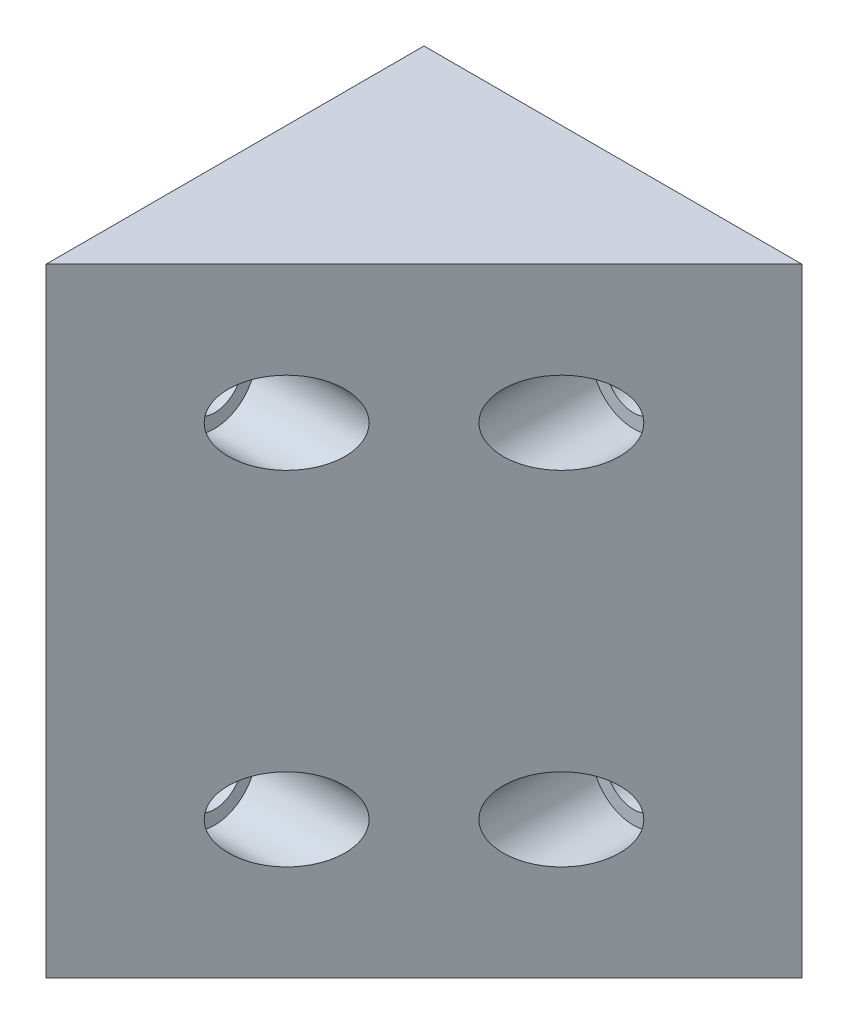
ISO-10303-21;
HEADER;
FILE_DESCRIPTION(('STEP AP214'),'2;1');
FILE_NAME('part.step','',(''),(''),'','','');
FILE_SCHEMA(('AUTOMOTIVE_DESIGN { 1 0 10303 214 1 1 1 1 }'));
ENDSEC;
DATA;
#1=APPLICATION_CONTEXT('core data for automotive mechanical design processes');
#2=APPLICATION_PROTOCOL_DEFINITION('international standard','automotive_design',2000,#1);
#3=PRODUCT_CONTEXT('',#1,'mechanical');
#4=PRODUCT('Part','Part','',(#3));
#5=PRODUCT_RELATED_PRODUCT_CATEGORY('part','',(#4));
#6=PRODUCT_DEFINITION_FORMATION('','',#4);
#7=PRODUCT_DEFINITION_CONTEXT('part definition',#1,'design');
#8=PRODUCT_DEFINITION('design','',#6,#7);
#9=PRODUCT_DEFINITION_SHAPE('','',#8);
#10=(LENGTH_UNIT() NAMED_UNIT(*) SI_UNIT(.MILLI.,.METRE.));
#11=(NAMED_UNIT(*) PLANE_ANGLE_UNIT() SI_UNIT($,.RADIAN.));
#12=(NAMED_UNIT(*) SI_UNIT($,.STERADIAN.) SOLID_ANGLE_UNIT());
#13=UNCERTAINTY_MEASURE_WITH_UNIT(LENGTH_MEASURE(1.E-05),#10,'distance_accuracy_value','');
#14=(GEOMETRIC_REPRESENTATION_CONTEXT(3) GLOBAL_UNCERTAINTY_ASSIGNED_CONTEXT((#13)) GLOBAL_UNIT_ASSIGNED_CONTEXT((#10,
#11,#12)) REPRESENTATION_CONTEXT('',''));
#15=CARTESIAN_POINT('',(0.,0.,0.));
#16=DIRECTION('',(0.,0.,1.));
#17=DIRECTION('',(1.,0.,0.));
#18=AXIS2_PLACEMENT_3D('',#15,#16,#17);
#19=CARTESIAN_POINT('',(0.,100.,0.));
#20=DIRECTION('',(1.,0.,0.));
#21=DIRECTION('',(0.,0.,-1.));
#22=AXIS2_PLACEMENT_3D('',#19,#20,#21);
#23=PLANE('',#22);
#24=CARTESIAN_POINT('',(0.,75.,-17.5));
#25=DIRECTION('',(1.,0.,0.));
#26=DIRECTION('',(0.,0.,-1.));
#27=AXIS2_PLACEMENT_3D('',#24,#25,#26);
#28=CIRCLE('',#27,4.);
#29=CARTESIAN_POINT('',(0.,75.,-21.5));
#30=VERTEX_POINT('',#29);
#31=EDGE_CURVE('E111',#30,#30,#28,.F.);
#32=ORIENTED_EDGE('',*,*,#31,.F.);
#33=EDGE_LOOP('',(#32));
#34=FACE_BOUND('',#33,.T.);
#35=CARTESIAN_POINT('',(0.,25.,-17.5));
#36=DIRECTION('',(1.,0.,0.));
#37=DIRECTION('',(0.,0.,-1.));
#38=AXIS2_PLACEMENT_3D('',#35,#36,#37);
#39=CIRCLE('',#38,4.);
#40=CARTESIAN_POINT('',(0.,25.,-21.5));
#41=VERTEX_POINT('',#40);
#42=EDGE_CURVE('E112',#41,#41,#39,.F.);
#43=ORIENTED_EDGE('',*,*,#42,.F.);
#44=EDGE_LOOP('',(#43));
#45=FACE_BOUND('',#44,.T.);
#46=DIRECTION('',(0.,-1.,0.));
#47=VECTOR('',#46,1.);
#48=CARTESIAN_POINT('',(0.,100.,0.));
#49=LINE('',#48,#47);
#50=CARTESIAN_POINT('',(0.,95.,0.));
#51=VERTEX_POINT('',#50);
#52=CARTESIAN_POINT('',(0.,5.,0.));
#53=VERTEX_POINT('',#52);
#54=EDGE_CURVE('E11',#51,#53,#49,.T.);
#55=ORIENTED_EDGE('',*,*,#54,.F.);
#56=DIRECTION('',(0.,0.,1.));
#57=VECTOR('',#56,1.);
#58=CARTESIAN_POINT('',(0.,95.,-110.226805085936));
#59=LINE('',#58,#57);
#60=CARTESIAN_POINT('',(0.,95.,-55.));
#61=VERTEX_POINT('',#60);
#62=EDGE_CURVE('E67',#61,#51,#59,.T.);
#63=ORIENTED_EDGE('',*,*,#62,.F.);
#64=DIRECTION('',(0.,-1.,0.));
#65=VECTOR('',#64,1.);
#66=CARTESIAN_POINT('',(0.,100.,-55.));
#67=LINE('',#66,#65);
#68=CARTESIAN_POINT('',(0.,5.,-55.));
#69=VERTEX_POINT('',#68);
#70=EDGE_CURVE('E84',#61,#69,#67,.T.);
#71=ORIENTED_EDGE('',*,*,#70,.T.);
#72=DIRECTION('',(0.,0.,1.));
#73=VECTOR('',#72,1.);
#74=CARTESIAN_POINT('',(0.,5.,-110.226805085936));
#75=LINE('',#74,#73);
#76=EDGE_CURVE('E57',#69,#53,#75,.T.);
#77=ORIENTED_EDGE('',*,*,#76,.T.);
#78=EDGE_LOOP('',(#55,#63,#71,#77));
#79=FACE_BOUND('',#78,.T.);
#80=ADVANCED_FACE('F33',(#34,#45,#79),#23,.F.);
#81=CARTESIAN_POINT('',(0.,100.,0.));
#82=DIRECTION('',(-0.707106781186548,0.,-0.707106781186548));
#83=DIRECTION('',(-0.707106781186548,0.,0.707106781186548));
#84=AXIS2_PLACEMENT_3D('',#81,#82,#83);
#85=PLANE('',#84);
#86=CARTESIAN_POINT('',(37.4999999999998,25.,-37.4999999999998));
#87=DIRECTION('',(-0.707106781186548,0.,-0.707106781186548));
#88=DIRECTION('',(-0.707106781186548,0.,0.707106781186548));
#89=AXIS2_PLACEMENT_3D('',#86,#87,#88);
#90=ELLIPSE('',#89,8.48528137423866,6.);
#91=CARTESIAN_POINT('',(31.4999999999998,25.,-31.4999999999998));
#92=VERTEX_POINT('',#91);
#93=EDGE_CURVE('E36',#92,#92,#90,.F.);
#94=ORIENTED_EDGE('',*,*,#93,.F.);
#95=EDGE_LOOP('',(#94));
#96=FACE_BOUND('',#95,.T.);
#97=CARTESIAN_POINT('',(37.4999999999998,75.,-37.4999999999998));
#98=DIRECTION('',(-0.707106781186548,0.,-0.707106781186548));
#99=DIRECTION('',(-0.707106781186548,0.,0.707106781186548));
#100=AXIS2_PLACEMENT_3D('',#97,#98,#99);
#101=ELLIPSE('',#100,8.48528137423866,6.);
#102=CARTESIAN_POINT('',(31.4999999999998,75.,-31.4999999999998));
#103=VERTEX_POINT('',#102);
#104=EDGE_CURVE('E105',#103,#103,#101,.F.);
#105=ORIENTED_EDGE('',*,*,#104,.F.);
#106=EDGE_LOOP('',(#105));
#107=FACE_BOUND('',#106,.T.);
#108=CARTESIAN_POINT('',(17.5,25.,-17.5));
#109=DIRECTION('',(-0.707106781186548,0.,-0.707106781186548));
#110=DIRECTION('',(0.707106781186548,0.,-0.707106781186548));
#111=AXIS2_PLACEMENT_3D('',#108,#109,#110);
#112=ELLIPSE('',#111,8.48528137423857,6.);
#113=CARTESIAN_POINT('',(23.5,25.,-23.5));
#114=VERTEX_POINT('',#113);
#115=EDGE_CURVE('E128',#114,#114,#112,.T.);
#116=ORIENTED_EDGE('',*,*,#115,.T.);
#117=EDGE_LOOP('',(#116));
#118=FACE_BOUND('',#117,.T.);
#119=CARTESIAN_POINT('',(17.5,75.,-17.5));
#120=DIRECTION('',(-0.707106781186548,0.,-0.707106781186548));
#121=DIRECTION('',(0.707106781186548,0.,-0.707106781186548));
#122=AXIS2_PLACEMENT_3D('',#119,#120,#121);
#123=ELLIPSE('',#122,8.48528137423857,6.);
#124=CARTESIAN_POINT('',(23.5,75.,-23.5));
#125=VERTEX_POINT('',#124);
#126=EDGE_CURVE('E124',#125,#125,#123,.T.);
#127=ORIENTED_EDGE('',*,*,#126,.T.);
#128=EDGE_LOOP('',(#127));
#129=FACE_BOUND('',#128,.T.);
#130=DIRECTION('',(0.,-1.,0.));
#131=VECTOR('',#130,1.);
#132=CARTESIAN_POINT('',(55.,100.,-55.));
#133=LINE('',#132,#131);
#134=CARTESIAN_POINT('',(55.,95.,-55.));
#135=VERTEX_POINT('',#134);
#136=CARTESIAN_POINT('',(55.,5.,-55.));
#137=VERTEX_POINT('',#136);
#138=EDGE_CURVE('E41',#135,#137,#133,.T.);
#139=ORIENTED_EDGE('',*,*,#138,.F.);
#140=DIRECTION('',(-0.707106781186548,0.,0.707106781186548));
#141=VECTOR('',#140,1.);
#142=CARTESIAN_POINT('',(0.,95.,0.));
#143=LINE('',#142,#141);
#144=EDGE_CURVE('E49',#135,#51,#143,.T.);
#145=ORIENTED_EDGE('',*,*,#144,.T.);
#146=ORIENTED_EDGE('',*,*,#54,.T.);
#147=DIRECTION('',(0.707106781186548,0.,-0.707106781186548));
#148=VECTOR('',#147,1.);
#149=CARTESIAN_POINT('',(0.,5.,0.));
#150=LINE('',#149,#148);
#151=EDGE_CURVE('E82',#53,#137,#150,.T.);
#152=ORIENTED_EDGE('',*,*,#151,.T.);
#153=EDGE_LOOP('',(#139,#145,#146,#152));
#154=FACE_BOUND('',#153,.T.);
#155=ADVANCED_FACE('F78',(#96,#107,#118,#129,#154),#85,.F.);
#156=CARTESIAN_POINT('',(0.,100.,-55.));
#157=DIRECTION('',(0.,0.,1.));
#158=DIRECTION('',(1.,0.,0.));
#159=AXIS2_PLACEMENT_3D('',#156,#157,#158);
#160=PLANE('',#159);
#161=CARTESIAN_POINT('',(37.4999999999999,75.,-55.));
#162=DIRECTION('',(0.,0.,1.));
#163=DIRECTION('',(1.,0.,0.));
#164=AXIS2_PLACEMENT_3D('',#161,#162,#163);
#165=CIRCLE('',#164,4.);
#166=CARTESIAN_POINT('',(41.4999999999999,75.,-55.));
#167=VERTEX_POINT('',#166);
#168=EDGE_CURVE('E93',#167,#167,#165,.F.);
#169=ORIENTED_EDGE('',*,*,#168,.F.);
#170=EDGE_LOOP('',(#169));
#171=FACE_BOUND('',#170,.T.);
#172=CARTESIAN_POINT('',(37.4999999999999,25.,-55.));
#173=DIRECTION('',(0.,0.,1.));
#174=DIRECTION('',(1.,0.,0.));
#175=AXIS2_PLACEMENT_3D('',#172,#173,#174);
#176=CIRCLE('',#175,4.);
#177=CARTESIAN_POINT('',(41.4999999999999,25.,-55.));
#178=VERTEX_POINT('',#177);
#179=EDGE_CURVE('E94',#178,#178,#176,.F.);
#180=ORIENTED_EDGE('',*,*,#179,.F.);
#181=EDGE_LOOP('',(#180));
#182=FACE_BOUND('',#181,.T.);
#183=ORIENTED_EDGE('',*,*,#70,.F.);
#184=DIRECTION('',(-1.,0.,0.));
#185=VECTOR('',#184,1.);
#186=CARTESIAN_POINT('',(0.,95.,-55.));
#187=LINE('',#186,#185);
#188=EDGE_CURVE('E69',#135,#61,#187,.T.);
#189=ORIENTED_EDGE('',*,*,#188,.F.);
#190=ORIENTED_EDGE('',*,*,#138,.T.);
#191=DIRECTION('',(1.,0.,0.));
#192=VECTOR('',#191,1.);
#193=CARTESIAN_POINT('',(0.,5.,-55.));
#194=LINE('',#193,#192);
#195=EDGE_CURVE('E74',#69,#137,#194,.T.);
#196=ORIENTED_EDGE('',*,*,#195,.F.);
#197=EDGE_LOOP('',(#183,#189,#190,#196));
#198=FACE_BOUND('',#197,.T.);
#199=ADVANCED_FACE('F143',(#171,#182,#198),#160,.F.);
#200=CARTESIAN_POINT('',(7.00000000000001,75.,-17.5));
#201=DIRECTION('',(1.,0.,0.));
#202=DIRECTION('',(0.,0.,-1.));
#203=AXIS2_PLACEMENT_3D('',#200,#201,#202);
#204=CYLINDRICAL_SURFACE('',#203,6.);
#205=CARTESIAN_POINT('',(7.00000000000001,75.,-17.5));
#206=DIRECTION('',(1.,0.,0.));
#207=DIRECTION('',(0.,0.,-1.));
#208=AXIS2_PLACEMENT_3D('',#205,#206,#207);
#209=CIRCLE('',#208,6.);
#210=CARTESIAN_POINT('',(7.00000000000001,75.,-23.5));
#211=VERTEX_POINT('',#210);
#212=EDGE_CURVE('E115',#211,#211,#209,.T.);
#213=ORIENTED_EDGE('',*,*,#212,.F.);
#214=EDGE_LOOP('',(#213));
#215=FACE_BOUND('',#214,.T.);
#216=ORIENTED_EDGE('',*,*,#126,.F.);
#217=EDGE_LOOP('',(#216));
#218=FACE_BOUND('',#217,.T.);
#219=ADVANCED_FACE('F149',(#215,#218),#204,.F.);
#220=CARTESIAN_POINT('',(7.00000000000001,75.,-17.5));
#221=DIRECTION('',(1.,0.,0.));
#222=DIRECTION('',(0.,0.,-1.));
#223=AXIS2_PLACEMENT_3D('',#220,#221,#222);
#224=PLANE('',#223);
#225=CARTESIAN_POINT('',(7.00000000000001,75.,-17.5));
#226=DIRECTION('',(1.,0.,0.));
#227=DIRECTION('',(0.,0.,-1.));
#228=AXIS2_PLACEMENT_3D('',#225,#226,#227);
#229=CIRCLE('',#228,4.);
#230=CARTESIAN_POINT('',(7.00000000000001,75.,-21.5));
#231=VERTEX_POINT('',#230);
#232=EDGE_CURVE('E108',#231,#231,#229,.T.);
#233=ORIENTED_EDGE('',*,*,#232,.F.);
#234=EDGE_LOOP('',(#233));
#235=FACE_BOUND('',#234,.T.);
#236=ORIENTED_EDGE('',*,*,#212,.T.);
#237=EDGE_LOOP('',(#236));
#238=FACE_BOUND('',#237,.T.);
#239=ADVANCED_FACE('F151',(#235,#238),#224,.T.);
#240=CARTESIAN_POINT('',(7.00000000000001,25.,-17.5));
#241=DIRECTION('',(1.,0.,0.));
#242=DIRECTION('',(0.,0.,-1.));
#243=AXIS2_PLACEMENT_3D('',#240,#241,#242);
#244=CYLINDRICAL_SURFACE('',#243,6.);
#245=CARTESIAN_POINT('',(7.00000000000001,25.,-17.5));
#246=DIRECTION('',(1.,0.,0.));
#247=DIRECTION('',(0.,0.,-1.));
#248=AXIS2_PLACEMENT_3D('',#245,#246,#247);
#249=CIRCLE('',#248,6.);
#250=CARTESIAN_POINT('',(7.00000000000001,25.,-23.5));
#251=VERTEX_POINT('',#250);
#252=EDGE_CURVE('E121',#251,#251,#249,.T.);
#253=ORIENTED_EDGE('',*,*,#252,.F.);
#254=EDGE_LOOP('',(#253));
#255=FACE_BOUND('',#254,.T.);
#256=ORIENTED_EDGE('',*,*,#115,.F.);
#257=EDGE_LOOP('',(#256));
#258=FACE_BOUND('',#257,.T.);
#259=ADVANCED_FACE('F158',(#255,#258),#244,.F.);
#260=CARTESIAN_POINT('',(7.00000000000001,25.,-17.5));
#261=DIRECTION('',(1.,0.,0.));
#262=DIRECTION('',(0.,0.,-1.));
#263=AXIS2_PLACEMENT_3D('',#260,#261,#262);
#264=PLANE('',#263);
#265=CARTESIAN_POINT('',(7.00000000000001,25.,-17.5));
#266=DIRECTION('',(1.,0.,0.));
#267=DIRECTION('',(0.,0.,-1.));
#268=AXIS2_PLACEMENT_3D('',#265,#266,#267);
#269=CIRCLE('',#268,4.);
#270=CARTESIAN_POINT('',(7.00000000000001,25.,-21.5));
#271=VERTEX_POINT('',#270);
#272=EDGE_CURVE('E116',#271,#271,#269,.T.);
#273=ORIENTED_EDGE('',*,*,#272,.F.);
#274=EDGE_LOOP('',(#273));
#275=FACE_BOUND('',#274,.T.);
#276=ORIENTED_EDGE('',*,*,#252,.T.);
#277=EDGE_LOOP('',(#276));
#278=FACE_BOUND('',#277,.T.);
#279=ADVANCED_FACE('F176',(#275,#278),#264,.T.);
#280=CARTESIAN_POINT('',(-11.3137084989848,25.,-17.5));
#281=DIRECTION('',(1.,0.,0.));
#282=DIRECTION('',(0.,0.,-1.));
#283=AXIS2_PLACEMENT_3D('',#280,#281,#282);
#284=CYLINDRICAL_SURFACE('',#283,4.);
#285=ORIENTED_EDGE('',*,*,#42,.T.);
#286=EDGE_LOOP('',(#285));
#287=FACE_BOUND('',#286,.T.);
#288=ORIENTED_EDGE('',*,*,#272,.T.);
#289=EDGE_LOOP('',(#288));
#290=FACE_BOUND('',#289,.T.);
#291=ADVANCED_FACE('F172',(#287,#290),#284,.F.);
#292=CARTESIAN_POINT('',(-11.3137084989848,75.,-17.5));
#293=DIRECTION('',(1.,0.,0.));
#294=DIRECTION('',(0.,0.,-1.));
#295=AXIS2_PLACEMENT_3D('',#292,#293,#294);
#296=CYLINDRICAL_SURFACE('',#295,4.);
#297=ORIENTED_EDGE('',*,*,#31,.T.);
#298=EDGE_LOOP('',(#297));
#299=FACE_BOUND('',#298,.T.);
#300=ORIENTED_EDGE('',*,*,#232,.T.);
#301=EDGE_LOOP('',(#300));
#302=FACE_BOUND('',#301,.T.);
#303=ADVANCED_FACE('F175',(#299,#302),#296,.F.);
#304=CARTESIAN_POINT('',(37.4999999999999,75.,-47.9999999999996));
#305=DIRECTION('',(0.,0.,1.));
#306=DIRECTION('',(1.,0.,0.));
#307=AXIS2_PLACEMENT_3D('',#304,#305,#306);
#308=CYLINDRICAL_SURFACE('',#307,6.);
#309=CARTESIAN_POINT('',(37.4999999999999,75.,-47.9999999999996));
#310=DIRECTION('',(0.,0.,-1.));
#311=DIRECTION('',(-1.,0.,0.));
#312=AXIS2_PLACEMENT_3D('',#309,#310,#311);
#313=CIRCLE('',#312,6.);
#314=CARTESIAN_POINT('',(31.4999999999999,75.,-47.9999999999997));
#315=VERTEX_POINT('',#314);
#316=EDGE_CURVE('E97',#315,#315,#313,.T.);
#317=ORIENTED_EDGE('',*,*,#316,.T.);
#318=EDGE_LOOP('',(#317));
#319=FACE_BOUND('',#318,.T.);
#320=ORIENTED_EDGE('',*,*,#104,.T.);
#321=EDGE_LOOP('',(#320));
#322=FACE_BOUND('',#321,.T.);
#323=ADVANCED_FACE('F193',(#319,#322),#308,.F.);
#324=CARTESIAN_POINT('',(37.4999999999999,75.,-47.9999999999996));
#325=DIRECTION('',(0.,0.,1.));
#326=DIRECTION('',(-1.,0.,0.));
#327=AXIS2_PLACEMENT_3D('',#324,#325,#326);
#328=PLANE('',#327);
#329=CARTESIAN_POINT('',(37.4999999999999,75.,-48.));
#330=DIRECTION('',(0.,0.,1.));
#331=DIRECTION('',(1.,0.,0.));
#332=AXIS2_PLACEMENT_3D('',#329,#330,#331);
#333=CIRCLE('',#332,4.);
#334=CARTESIAN_POINT('',(41.4999999999999,75.,-48.));
#335=VERTEX_POINT('',#334);
#336=EDGE_CURVE('E90',#335,#335,#333,.T.);
#337=ORIENTED_EDGE('',*,*,#336,.F.);
#338=EDGE_LOOP('',(#337));
#339=FACE_BOUND('',#338,.T.);
#340=ORIENTED_EDGE('',*,*,#316,.F.);
#341=EDGE_LOOP('',(#340));
#342=FACE_BOUND('',#341,.T.);
#343=ADVANCED_FACE('F197',(#339,#342),#328,.T.);
#344=CARTESIAN_POINT('',(37.4999999999999,25.,-47.9999999999996));
#345=DIRECTION('',(0.,0.,1.));
#346=DIRECTION('',(1.,0.,0.));
#347=AXIS2_PLACEMENT_3D('',#344,#345,#346);
#348=CYLINDRICAL_SURFACE('',#347,6.);
#349=CARTESIAN_POINT('',(37.4999999999999,25.,-47.9999999999996));
#350=DIRECTION('',(0.,0.,-1.));
#351=DIRECTION('',(-1.,0.,0.));
#352=AXIS2_PLACEMENT_3D('',#349,#350,#351);
#353=CIRCLE('',#352,6.);
#354=CARTESIAN_POINT('',(31.4999999999999,25.,-47.9999999999997));
#355=VERTEX_POINT('',#354);
#356=EDGE_CURVE('E102',#355,#355,#353,.T.);
#357=ORIENTED_EDGE('',*,*,#356,.T.);
#358=EDGE_LOOP('',(#357));
#359=FACE_BOUND('',#358,.T.);
#360=ORIENTED_EDGE('',*,*,#93,.T.);
#361=EDGE_LOOP('',(#360));
#362=FACE_BOUND('',#361,.T.);
#363=ADVANCED_FACE('F139',(#359,#362),#348,.F.);
#364=CARTESIAN_POINT('',(37.4999999999999,25.,-47.9999999999996));
#365=DIRECTION('',(0.,0.,1.));
#366=DIRECTION('',(-1.,0.,0.));
#367=AXIS2_PLACEMENT_3D('',#364,#365,#366);
#368=PLANE('',#367);
#369=CARTESIAN_POINT('',(37.4999999999999,25.,-48.));
#370=DIRECTION('',(0.,0.,1.));
#371=DIRECTION('',(1.,0.,0.));
#372=AXIS2_PLACEMENT_3D('',#369,#370,#371);
#373=CIRCLE('',#372,4.);
#374=CARTESIAN_POINT('',(41.4999999999999,25.,-48.));
#375=VERTEX_POINT('',#374);
#376=EDGE_CURVE('E81',#375,#375,#373,.T.);
#377=ORIENTED_EDGE('',*,*,#376,.F.);
#378=EDGE_LOOP('',(#377));
#379=FACE_BOUND('',#378,.T.);
#380=ORIENTED_EDGE('',*,*,#356,.F.);
#381=EDGE_LOOP('',(#380));
#382=FACE_BOUND('',#381,.T.);
#383=ADVANCED_FACE('F204',(#379,#382),#368,.T.);
#384=CARTESIAN_POINT('',(37.4999999999999,25.,-66.3137084989848));
#385=DIRECTION('',(0.,0.,1.));
#386=DIRECTION('',(1.,0.,0.));
#387=AXIS2_PLACEMENT_3D('',#384,#385,#386);
#388=CYLINDRICAL_SURFACE('',#387,4.);
#389=ORIENTED_EDGE('',*,*,#179,.T.);
#390=EDGE_LOOP('',(#389));
#391=FACE_BOUND('',#390,.T.);
#392=ORIENTED_EDGE('',*,*,#376,.T.);
#393=EDGE_LOOP('',(#392));
#394=FACE_BOUND('',#393,.T.);
#395=ADVANCED_FACE('F208',(#391,#394),#388,.F.);
#396=CARTESIAN_POINT('',(37.4999999999999,75.,-66.3137084989848));
#397=DIRECTION('',(0.,0.,1.));
#398=DIRECTION('',(1.,0.,0.));
#399=AXIS2_PLACEMENT_3D('',#396,#397,#398);
#400=CYLINDRICAL_SURFACE('',#399,4.);
#401=ORIENTED_EDGE('',*,*,#168,.T.);
#402=EDGE_LOOP('',(#401));
#403=FACE_BOUND('',#402,.T.);
#404=ORIENTED_EDGE('',*,*,#336,.T.);
#405=EDGE_LOOP('',(#404));
#406=FACE_BOUND('',#405,.T.);
#407=ADVANCED_FACE('F212',(#403,#406),#400,.F.);
#408=CARTESIAN_POINT('',(0.,5.,-110.226805085936));
#409=DIRECTION('',(0.,1.,0.));
#410=DIRECTION('',(0.,0.,1.));
#411=AXIS2_PLACEMENT_3D('',#408,#409,#410);
#412=PLANE('',#411);
#413=ORIENTED_EDGE('',*,*,#76,.F.);
#414=ORIENTED_EDGE('',*,*,#195,.T.);
#415=ORIENTED_EDGE('',*,*,#151,.F.);
#416=EDGE_LOOP('',(#413,#414,#415));
#417=FACE_BOUND('',#416,.T.);
#418=ADVANCED_FACE('F216',(#417),#412,.F.);
#419=CARTESIAN_POINT('',(0.,95.,-110.226805085936));
#420=DIRECTION('',(0.,-1.,0.));
#421=DIRECTION('',(0.,0.,-1.));
#422=AXIS2_PLACEMENT_3D('',#419,#420,#421);
#423=PLANE('',#422);
#424=ORIENTED_EDGE('',*,*,#188,.T.);
#425=ORIENTED_EDGE('',*,*,#62,.T.);
#426=ORIENTED_EDGE('',*,*,#144,.F.);
#427=EDGE_LOOP('',(#424,#425,#426));
#428=FACE_BOUND('',#427,.T.);
#429=ADVANCED_FACE('F68',(#428),#423,.F.);
#430=CLOSED_SHELL('',(#80,#155,#199,#219,#239,#259,#279,#291,#303,#323,#343,#363,#383,#395,#407,
#418,#429));
#431=MANIFOLD_SOLID_BREP('B2',#430);
#432=ADVANCED_BREP_SHAPE_REPRESENTATION('',(#18,#431),#14);
#433=SHAPE_DEFINITION_REPRESENTATION(#9,#432);
ENDSEC;
END-ISO-10303-21;
